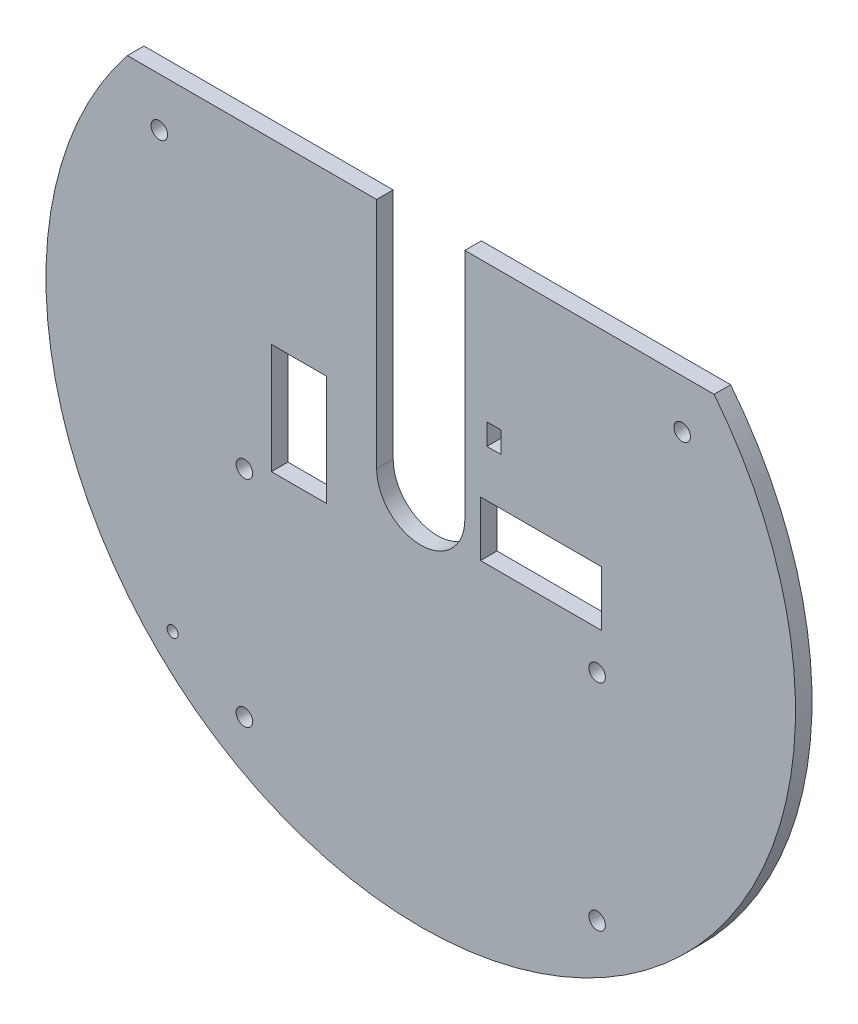
ISO-10303-21;
HEADER;
FILE_DESCRIPTION(('STEP AP214'),'2;1');
FILE_NAME('part.step','',(''),(''),'','','');
FILE_SCHEMA(('AUTOMOTIVE_DESIGN { 1 0 10303 214 1 1 1 1 }'));
ENDSEC;
DATA;
#1=APPLICATION_CONTEXT('core data for automotive mechanical design processes');
#2=APPLICATION_PROTOCOL_DEFINITION('international standard','automotive_design',2000,#1);
#3=PRODUCT_CONTEXT('',#1,'mechanical');
#4=PRODUCT('Part','Part','',(#3));
#5=PRODUCT_RELATED_PRODUCT_CATEGORY('part','',(#4));
#6=PRODUCT_DEFINITION_FORMATION('','',#4);
#7=PRODUCT_DEFINITION_CONTEXT('part definition',#1,'design');
#8=PRODUCT_DEFINITION('design','',#6,#7);
#9=PRODUCT_DEFINITION_SHAPE('','',#8);
#10=(LENGTH_UNIT() NAMED_UNIT(*) SI_UNIT(.MILLI.,.METRE.));
#11=(NAMED_UNIT(*) PLANE_ANGLE_UNIT() SI_UNIT($,.RADIAN.));
#12=(NAMED_UNIT(*) SI_UNIT($,.STERADIAN.) SOLID_ANGLE_UNIT());
#13=UNCERTAINTY_MEASURE_WITH_UNIT(LENGTH_MEASURE(1.E-05),#10,'distance_accuracy_value','');
#14=(GEOMETRIC_REPRESENTATION_CONTEXT(3) GLOBAL_UNCERTAINTY_ASSIGNED_CONTEXT((#13)) GLOBAL_UNIT_ASSIGNED_CONTEXT((#10,
#11,#12)) REPRESENTATION_CONTEXT('',''));
#15=CARTESIAN_POINT('',(0.,0.,0.));
#16=DIRECTION('',(0.,0.,1.));
#17=DIRECTION('',(1.,0.,0.));
#18=AXIS2_PLACEMENT_3D('',#15,#16,#17);
#19=CARTESIAN_POINT('',(0.,0.,3.));
#20=DIRECTION('',(0.,0.,1.));
#21=DIRECTION('',(1.,0.,0.));
#22=AXIS2_PLACEMENT_3D('',#19,#20,#21);
#23=PLANE('',#22);
#24=DIRECTION('',(0.,1.,0.));
#25=VECTOR('',#24,1.);
#26=CARTESIAN_POINT('',(14.6,17.3801510258683,3.));
#27=LINE('',#26,#25);
#28=CARTESIAN_POINT('',(14.6,13.5189651370882,3.));
#29=VERTEX_POINT('',#28);
#30=CARTESIAN_POINT('',(14.6,17.3801510258683,3.));
#31=VERTEX_POINT('',#30);
#32=EDGE_CURVE('E61',#29,#31,#27,.T.);
#33=ORIENTED_EDGE('',*,*,#32,.F.);
#34=DIRECTION('',(1.,0.,0.));
#35=VECTOR('',#34,1.);
#36=CARTESIAN_POINT('',(12.,13.5189651370882,3.));
#37=LINE('',#36,#35);
#38=CARTESIAN_POINT('',(12.,13.5189651370882,3.));
#39=VERTEX_POINT('',#38);
#40=EDGE_CURVE('E192',#39,#29,#37,.T.);
#41=ORIENTED_EDGE('',*,*,#40,.F.);
#42=DIRECTION('',(0.,-1.,0.));
#43=VECTOR('',#42,1.);
#44=CARTESIAN_POINT('',(12.,17.3801510258683,3.));
#45=LINE('',#44,#43);
#46=CARTESIAN_POINT('',(12.,17.3801510258683,3.));
#47=VERTEX_POINT('',#46);
#48=EDGE_CURVE('E196',#47,#39,#45,.T.);
#49=ORIENTED_EDGE('',*,*,#48,.F.);
#50=DIRECTION('',(-1.,0.,0.));
#51=VECTOR('',#50,1.);
#52=CARTESIAN_POINT('',(12.,17.3801510258683,3.));
#53=LINE('',#52,#51);
#54=EDGE_CURVE('E205',#31,#47,#53,.T.);
#55=ORIENTED_EDGE('',*,*,#54,.F.);
#56=EDGE_LOOP('',(#33,#41,#49,#55));
#57=FACE_BOUND('',#56,.T.);
#58=CARTESIAN_POINT('',(32.,-51.,3.));
#59=DIRECTION('',(0.,0.,1.));
#60=DIRECTION('',(-1.,0.,0.));
#61=AXIS2_PLACEMENT_3D('',#58,#59,#60);
#62=CIRCLE('',#61,1.5);
#63=CARTESIAN_POINT('',(30.5,-51.,3.));
#64=VERTEX_POINT('',#63);
#65=EDGE_CURVE('E271',#64,#64,#62,.T.);
#66=ORIENTED_EDGE('',*,*,#65,.F.);
#67=EDGE_LOOP('',(#66));
#68=FACE_BOUND('',#67,.T.);
#69=CARTESIAN_POINT('',(-32.,-12.,3.));
#70=DIRECTION('',(0.,0.,1.));
#71=DIRECTION('',(1.,0.,0.));
#72=AXIS2_PLACEMENT_3D('',#69,#70,#71);
#73=CIRCLE('',#72,1.5);
#74=CARTESIAN_POINT('',(-30.5,-12.,3.));
#75=VERTEX_POINT('',#74);
#76=EDGE_CURVE('E287',#75,#75,#73,.T.);
#77=ORIENTED_EDGE('',*,*,#76,.F.);
#78=EDGE_LOOP('',(#77));
#79=FACE_BOUND('',#78,.T.);
#80=CARTESIAN_POINT('',(-45.012826675006,-44.0777203893971,3.));
#81=DIRECTION('',(0.,0.,1.));
#82=DIRECTION('',(1.,0.,0.));
#83=AXIS2_PLACEMENT_3D('',#80,#81,#82);
#84=CIRCLE('',#83,0.999999999999998);
#85=CARTESIAN_POINT('',(-44.012826675006,-44.0777203893971,3.));
#86=VERTEX_POINT('',#85);
#87=EDGE_CURVE('E303',#86,#86,#84,.T.);
#88=ORIENTED_EDGE('',*,*,#87,.F.);
#89=EDGE_LOOP('',(#88));
#90=FACE_BOUND('',#89,.T.);
#91=DIRECTION('',(1.,0.,0.));
#92=VECTOR('',#91,1.);
#93=CARTESIAN_POINT('',(32.8437854274862,-5.,3.));
#94=LINE('',#93,#92);
#95=CARTESIAN_POINT('',(10.8437854274862,-5.,3.));
#96=VERTEX_POINT('',#95);
#97=CARTESIAN_POINT('',(32.8437854274862,-5.,3.));
#98=VERTEX_POINT('',#97);
#99=EDGE_CURVE('E322',#96,#98,#94,.T.);
#100=ORIENTED_EDGE('',*,*,#99,.F.);
#101=DIRECTION('',(0.,-1.,0.));
#102=VECTOR('',#101,1.);
#103=CARTESIAN_POINT('',(10.8437854274862,5.,3.));
#104=LINE('',#103,#102);
#105=CARTESIAN_POINT('',(10.8437854274862,5.,3.));
#106=VERTEX_POINT('',#105);
#107=EDGE_CURVE('E319',#106,#96,#104,.T.);
#108=ORIENTED_EDGE('',*,*,#107,.F.);
#109=DIRECTION('',(-1.,0.,0.));
#110=VECTOR('',#109,1.);
#111=CARTESIAN_POINT('',(32.8437854274862,5.,3.));
#112=LINE('',#111,#110);
#113=CARTESIAN_POINT('',(32.8437854274862,5.,3.));
#114=VERTEX_POINT('',#113);
#115=EDGE_CURVE('E330',#114,#106,#112,.T.);
#116=ORIENTED_EDGE('',*,*,#115,.F.);
#117=DIRECTION('',(0.,1.,0.));
#118=VECTOR('',#117,1.);
#119=CARTESIAN_POINT('',(32.8437854274862,5.,3.));
#120=LINE('',#119,#118);
#121=EDGE_CURVE('E326',#98,#114,#120,.T.);
#122=ORIENTED_EDGE('',*,*,#121,.F.);
#123=EDGE_LOOP('',(#100,#108,#116,#122));
#124=FACE_BOUND('',#123,.T.);
#125=CARTESIAN_POINT('',(0.,0.,3.));
#126=DIRECTION('',(0.,0.,1.));
#127=DIRECTION('',(1.,0.,0.));
#128=AXIS2_PLACEMENT_3D('',#125,#126,#127);
#129=CIRCLE('',#128,68.);
#130=CARTESIAN_POINT('',(-53.2269216630636,42.3189651370882,3.));
#131=VERTEX_POINT('',#130);
#132=CARTESIAN_POINT('',(53.2269216630636,42.3189651370882,3.));
#133=VERTEX_POINT('',#132);
#134=EDGE_CURVE('E362',#131,#133,#129,.T.);
#135=ORIENTED_EDGE('',*,*,#134,.T.);
#136=DIRECTION('',(-1.,0.,0.));
#137=VECTOR('',#136,1.);
#138=CARTESIAN_POINT('',(53.2269216630636,42.3189651370882,3.));
#139=LINE('',#138,#137);
#140=CARTESIAN_POINT('',(8.,42.3189651370882,3.));
#141=VERTEX_POINT('',#140);
#142=EDGE_CURVE('E366',#133,#141,#139,.T.);
#143=ORIENTED_EDGE('',*,*,#142,.T.);
#144=DIRECTION('',(0.,-1.,0.));
#145=VECTOR('',#144,1.);
#146=CARTESIAN_POINT('',(8.,42.3189651370882,3.));
#147=LINE('',#146,#145);
#148=CARTESIAN_POINT('',(8.,0.,3.));
#149=VERTEX_POINT('',#148);
#150=EDGE_CURVE('E370',#141,#149,#147,.T.);
#151=ORIENTED_EDGE('',*,*,#150,.T.);
#152=CARTESIAN_POINT('',(0.,0.,3.));
#153=DIRECTION('',(0.,0.,-1.));
#154=DIRECTION('',(1.,0.,0.));
#155=AXIS2_PLACEMENT_3D('',#152,#153,#154);
#156=CIRCLE('',#155,8.);
#157=CARTESIAN_POINT('',(-8.,0.,3.));
#158=VERTEX_POINT('',#157);
#159=EDGE_CURVE('E373',#149,#158,#156,.T.);
#160=ORIENTED_EDGE('',*,*,#159,.T.);
#161=DIRECTION('',(0.,1.,0.));
#162=VECTOR('',#161,1.);
#163=CARTESIAN_POINT('',(-8.,0.,3.));
#164=LINE('',#163,#162);
#165=CARTESIAN_POINT('',(-8.,42.3189651370882,3.));
#166=VERTEX_POINT('',#165);
#167=EDGE_CURVE('E376',#158,#166,#164,.T.);
#168=ORIENTED_EDGE('',*,*,#167,.T.);
#169=DIRECTION('',(-1.,0.,0.));
#170=VECTOR('',#169,1.);
#171=CARTESIAN_POINT('',(-8.,42.3189651370882,3.));
#172=LINE('',#171,#170);
#173=EDGE_CURVE('E379',#166,#131,#172,.T.);
#174=ORIENTED_EDGE('',*,*,#173,.T.);
#175=EDGE_LOOP('',(#135,#143,#151,#160,#168,#174));
#176=FACE_BOUND('',#175,.T.);
#177=CARTESIAN_POINT('',(47.4303280748359,33.5,3.));
#178=DIRECTION('',(0.,0.,1.));
#179=DIRECTION('',(-1.,0.,0.));
#180=AXIS2_PLACEMENT_3D('',#177,#178,#179);
#181=CIRCLE('',#180,1.5);
#182=CARTESIAN_POINT('',(45.9303280748359,33.5,3.));
#183=VERTEX_POINT('',#182);
#184=EDGE_CURVE('E311',#183,#183,#181,.T.);
#185=ORIENTED_EDGE('',*,*,#184,.F.);
#186=EDGE_LOOP('',(#185));
#187=FACE_BOUND('',#186,.T.);
#188=CARTESIAN_POINT('',(-47.4303280748359,33.5,3.));
#189=DIRECTION('',(0.,0.,1.));
#190=DIRECTION('',(1.,0.,0.));
#191=AXIS2_PLACEMENT_3D('',#188,#189,#190);
#192=CIRCLE('',#191,1.5);
#193=CARTESIAN_POINT('',(-45.9303280748359,33.5,3.));
#194=VERTEX_POINT('',#193);
#195=EDGE_CURVE('E295',#194,#194,#192,.T.);
#196=ORIENTED_EDGE('',*,*,#195,.F.);
#197=EDGE_LOOP('',(#196));
#198=FACE_BOUND('',#197,.T.);
#199=CARTESIAN_POINT('',(-32.,-51.,3.));
#200=DIRECTION('',(0.,0.,1.));
#201=DIRECTION('',(1.,0.,0.));
#202=AXIS2_PLACEMENT_3D('',#199,#200,#201);
#203=CIRCLE('',#202,1.5);
#204=CARTESIAN_POINT('',(-30.5,-51.,3.));
#205=VERTEX_POINT('',#204);
#206=EDGE_CURVE('E279',#205,#205,#203,.T.);
#207=ORIENTED_EDGE('',*,*,#206,.F.);
#208=EDGE_LOOP('',(#207));
#209=FACE_BOUND('',#208,.T.);
#210=CARTESIAN_POINT('',(32.,-12.,3.));
#211=DIRECTION('',(0.,0.,1.));
#212=DIRECTION('',(-1.,0.,0.));
#213=AXIS2_PLACEMENT_3D('',#210,#211,#212);
#214=CIRCLE('',#213,1.5);
#215=CARTESIAN_POINT('',(30.5,-12.,3.));
#216=VERTEX_POINT('',#215);
#217=EDGE_CURVE('E263',#216,#216,#214,.T.);
#218=ORIENTED_EDGE('',*,*,#217,.F.);
#219=EDGE_LOOP('',(#218));
#220=FACE_BOUND('',#219,.T.);
#221=DIRECTION('',(-1.,0.,0.));
#222=VECTOR('',#221,1.);
#223=CARTESIAN_POINT('',(-27.0947150978087,9.99999999999999,3.));
#224=LINE('',#223,#222);
#225=CARTESIAN_POINT('',(-17.0947150978087,9.99999999999999,3.));
#226=VERTEX_POINT('',#225);
#227=CARTESIAN_POINT('',(-27.0947150978087,9.99999999999999,3.));
#228=VERTEX_POINT('',#227);
#229=EDGE_CURVE('E223',#226,#228,#224,.T.);
#230=ORIENTED_EDGE('',*,*,#229,.F.);
#231=DIRECTION('',(0.,1.,0.));
#232=VECTOR('',#231,1.);
#233=CARTESIAN_POINT('',(-17.0947150978087,9.99999999999999,3.));
#234=LINE('',#233,#232);
#235=CARTESIAN_POINT('',(-17.0947150978087,-10.,3.));
#236=VERTEX_POINT('',#235);
#237=EDGE_CURVE('E220',#236,#226,#234,.T.);
#238=ORIENTED_EDGE('',*,*,#237,.F.);
#239=DIRECTION('',(1.,0.,0.));
#240=VECTOR('',#239,1.);
#241=CARTESIAN_POINT('',(-27.0947150978087,-10.,3.));
#242=LINE('',#241,#240);
#243=CARTESIAN_POINT('',(-27.0947150978087,-10.,3.));
#244=VERTEX_POINT('',#243);
#245=EDGE_CURVE('E231',#244,#236,#242,.T.);
#246=ORIENTED_EDGE('',*,*,#245,.F.);
#247=DIRECTION('',(0.,-1.,0.));
#248=VECTOR('',#247,1.);
#249=CARTESIAN_POINT('',(-27.0947150978087,9.99999999999999,3.));
#250=LINE('',#249,#248);
#251=EDGE_CURVE('E227',#228,#244,#250,.T.);
#252=ORIENTED_EDGE('',*,*,#251,.F.);
#253=EDGE_LOOP('',(#230,#238,#246,#252));
#254=FACE_BOUND('',#253,.T.);
#255=ADVANCED_FACE('F45',(#57,#68,#79,#90,#124,#176,#187,#198,#209,#220,#254),#23,.T.);
#256=CARTESIAN_POINT('',(0.,0.,0.));
#257=DIRECTION('',(0.,0.,1.));
#258=DIRECTION('',(1.,0.,0.));
#259=AXIS2_PLACEMENT_3D('',#256,#257,#258);
#260=PLANE('',#259);
#261=DIRECTION('',(1.,0.,0.));
#262=VECTOR('',#261,1.);
#263=CARTESIAN_POINT('',(12.,13.5189651370882,0.));
#264=LINE('',#263,#262);
#265=CARTESIAN_POINT('',(12.,13.5189651370882,0.));
#266=VERTEX_POINT('',#265);
#267=CARTESIAN_POINT('',(14.6,13.5189651370882,0.));
#268=VERTEX_POINT('',#267);
#269=EDGE_CURVE('E180',#266,#268,#264,.T.);
#270=ORIENTED_EDGE('',*,*,#269,.T.);
#271=DIRECTION('',(0.,1.,0.));
#272=VECTOR('',#271,1.);
#273=CARTESIAN_POINT('',(14.6,17.3801510258683,0.));
#274=LINE('',#273,#272);
#275=CARTESIAN_POINT('',(14.6,17.3801510258683,0.));
#276=VERTEX_POINT('',#275);
#277=EDGE_CURVE('E173',#268,#276,#274,.T.);
#278=ORIENTED_EDGE('',*,*,#277,.T.);
#279=DIRECTION('',(-1.,0.,0.));
#280=VECTOR('',#279,1.);
#281=CARTESIAN_POINT('',(12.,17.3801510258683,0.));
#282=LINE('',#281,#280);
#283=CARTESIAN_POINT('',(12.,17.3801510258683,0.));
#284=VERTEX_POINT('',#283);
#285=EDGE_CURVE('E183',#276,#284,#282,.T.);
#286=ORIENTED_EDGE('',*,*,#285,.T.);
#287=DIRECTION('',(0.,-1.,0.));
#288=VECTOR('',#287,1.);
#289=CARTESIAN_POINT('',(12.,17.3801510258683,0.));
#290=LINE('',#289,#288);
#291=EDGE_CURVE('E69',#284,#266,#290,.T.);
#292=ORIENTED_EDGE('',*,*,#291,.T.);
#293=EDGE_LOOP('',(#270,#278,#286,#292));
#294=FACE_BOUND('',#293,.T.);
#295=CARTESIAN_POINT('',(32.,-12.,0.));
#296=DIRECTION('',(0.,0.,1.));
#297=DIRECTION('',(-1.,0.,0.));
#298=AXIS2_PLACEMENT_3D('',#295,#296,#297);
#299=CIRCLE('',#298,1.5);
#300=CARTESIAN_POINT('',(30.5,-12.,0.));
#301=VERTEX_POINT('',#300);
#302=EDGE_CURVE('E262',#301,#301,#299,.T.);
#303=ORIENTED_EDGE('',*,*,#302,.T.);
#304=EDGE_LOOP('',(#303));
#305=FACE_BOUND('',#304,.T.);
#306=CARTESIAN_POINT('',(32.,-51.,0.));
#307=DIRECTION('',(0.,0.,1.));
#308=DIRECTION('',(-1.,0.,0.));
#309=AXIS2_PLACEMENT_3D('',#306,#307,#308);
#310=CIRCLE('',#309,1.5);
#311=CARTESIAN_POINT('',(30.5,-51.,0.));
#312=VERTEX_POINT('',#311);
#313=EDGE_CURVE('E267',#312,#312,#310,.T.);
#314=ORIENTED_EDGE('',*,*,#313,.T.);
#315=EDGE_LOOP('',(#314));
#316=FACE_BOUND('',#315,.T.);
#317=CARTESIAN_POINT('',(-32.,-51.,0.));
#318=DIRECTION('',(0.,0.,1.));
#319=DIRECTION('',(1.,0.,0.));
#320=AXIS2_PLACEMENT_3D('',#317,#318,#319);
#321=CIRCLE('',#320,1.5);
#322=CARTESIAN_POINT('',(-30.5,-51.,0.));
#323=VERTEX_POINT('',#322);
#324=EDGE_CURVE('E275',#323,#323,#321,.T.);
#325=ORIENTED_EDGE('',*,*,#324,.T.);
#326=EDGE_LOOP('',(#325));
#327=FACE_BOUND('',#326,.T.);
#328=CARTESIAN_POINT('',(-32.,-12.,0.));
#329=DIRECTION('',(0.,0.,1.));
#330=DIRECTION('',(1.,0.,0.));
#331=AXIS2_PLACEMENT_3D('',#328,#329,#330);
#332=CIRCLE('',#331,1.5);
#333=CARTESIAN_POINT('',(-30.5,-12.,0.));
#334=VERTEX_POINT('',#333);
#335=EDGE_CURVE('E283',#334,#334,#332,.T.);
#336=ORIENTED_EDGE('',*,*,#335,.T.);
#337=EDGE_LOOP('',(#336));
#338=FACE_BOUND('',#337,.T.);
#339=CARTESIAN_POINT('',(-47.4303280748359,33.5,0.));
#340=DIRECTION('',(0.,0.,1.));
#341=DIRECTION('',(1.,0.,0.));
#342=AXIS2_PLACEMENT_3D('',#339,#340,#341);
#343=CIRCLE('',#342,1.5);
#344=CARTESIAN_POINT('',(-45.9303280748359,33.5,0.));
#345=VERTEX_POINT('',#344);
#346=EDGE_CURVE('E291',#345,#345,#343,.T.);
#347=ORIENTED_EDGE('',*,*,#346,.T.);
#348=EDGE_LOOP('',(#347));
#349=FACE_BOUND('',#348,.T.);
#350=CARTESIAN_POINT('',(-45.012826675006,-44.0777203893971,0.));
#351=DIRECTION('',(0.,0.,1.));
#352=DIRECTION('',(1.,0.,0.));
#353=AXIS2_PLACEMENT_3D('',#350,#351,#352);
#354=CIRCLE('',#353,0.999999999999998);
#355=CARTESIAN_POINT('',(-44.012826675006,-44.0777203893971,0.));
#356=VERTEX_POINT('',#355);
#357=EDGE_CURVE('E299',#356,#356,#354,.T.);
#358=ORIENTED_EDGE('',*,*,#357,.T.);
#359=EDGE_LOOP('',(#358));
#360=FACE_BOUND('',#359,.T.);
#361=CARTESIAN_POINT('',(47.4303280748359,33.5,0.));
#362=DIRECTION('',(0.,0.,1.));
#363=DIRECTION('',(-1.,0.,0.));
#364=AXIS2_PLACEMENT_3D('',#361,#362,#363);
#365=CIRCLE('',#364,1.5);
#366=CARTESIAN_POINT('',(45.9303280748359,33.5,0.));
#367=VERTEX_POINT('',#366);
#368=EDGE_CURVE('E307',#367,#367,#365,.T.);
#369=ORIENTED_EDGE('',*,*,#368,.T.);
#370=EDGE_LOOP('',(#369));
#371=FACE_BOUND('',#370,.T.);
#372=DIRECTION('',(0.,-1.,0.));
#373=VECTOR('',#372,1.);
#374=CARTESIAN_POINT('',(10.8437854274862,5.,0.));
#375=LINE('',#374,#373);
#376=CARTESIAN_POINT('',(10.8437854274862,5.,0.));
#377=VERTEX_POINT('',#376);
#378=CARTESIAN_POINT('',(10.8437854274862,-5.,0.));
#379=VERTEX_POINT('',#378);
#380=EDGE_CURVE('E315',#377,#379,#375,.T.);
#381=ORIENTED_EDGE('',*,*,#380,.T.);
#382=DIRECTION('',(1.,0.,0.));
#383=VECTOR('',#382,1.);
#384=CARTESIAN_POINT('',(32.8437854274862,-5.,0.));
#385=LINE('',#384,#383);
#386=CARTESIAN_POINT('',(32.8437854274862,-5.,0.));
#387=VERTEX_POINT('',#386);
#388=EDGE_CURVE('E337',#379,#387,#385,.T.);
#389=ORIENTED_EDGE('',*,*,#388,.T.);
#390=DIRECTION('',(0.,1.,0.));
#391=VECTOR('',#390,1.);
#392=CARTESIAN_POINT('',(32.8437854274862,5.,0.));
#393=LINE('',#392,#391);
#394=CARTESIAN_POINT('',(32.8437854274862,5.,0.));
#395=VERTEX_POINT('',#394);
#396=EDGE_CURVE('E341',#387,#395,#393,.T.);
#397=ORIENTED_EDGE('',*,*,#396,.T.);
#398=DIRECTION('',(-1.,0.,0.));
#399=VECTOR('',#398,1.);
#400=CARTESIAN_POINT('',(32.8437854274862,5.,0.));
#401=LINE('',#400,#399);
#402=EDGE_CURVE('E323',#395,#377,#401,.T.);
#403=ORIENTED_EDGE('',*,*,#402,.T.);
#404=EDGE_LOOP('',(#381,#389,#397,#403));
#405=FACE_BOUND('',#404,.T.);
#406=CARTESIAN_POINT('',(0.,0.,0.));
#407=DIRECTION('',(0.,0.,1.));
#408=DIRECTION('',(1.,0.,0.));
#409=AXIS2_PLACEMENT_3D('',#406,#407,#408);
#410=CIRCLE('',#409,68.);
#411=CARTESIAN_POINT('',(-53.2269216630636,42.3189651370882,0.));
#412=VERTEX_POINT('',#411);
#413=CARTESIAN_POINT('',(53.2269216630636,42.3189651370882,0.));
#414=VERTEX_POINT('',#413);
#415=EDGE_CURVE('E361',#412,#414,#410,.T.);
#416=ORIENTED_EDGE('',*,*,#415,.F.);
#417=DIRECTION('',(-1.,0.,0.));
#418=VECTOR('',#417,1.);
#419=CARTESIAN_POINT('',(-8.,42.3189651370882,0.));
#420=LINE('',#419,#418);
#421=CARTESIAN_POINT('',(-8.,42.3189651370882,0.));
#422=VERTEX_POINT('',#421);
#423=EDGE_CURVE('E367',#422,#412,#420,.T.);
#424=ORIENTED_EDGE('',*,*,#423,.F.);
#425=DIRECTION('',(0.,1.,0.));
#426=VECTOR('',#425,1.);
#427=CARTESIAN_POINT('',(-8.,0.,0.));
#428=LINE('',#427,#426);
#429=CARTESIAN_POINT('',(-8.,0.,0.));
#430=VERTEX_POINT('',#429);
#431=EDGE_CURVE('E395',#430,#422,#428,.T.);
#432=ORIENTED_EDGE('',*,*,#431,.F.);
#433=CARTESIAN_POINT('',(0.,0.,0.));
#434=DIRECTION('',(0.,0.,-1.));
#435=DIRECTION('',(1.,0.,0.));
#436=AXIS2_PLACEMENT_3D('',#433,#434,#435);
#437=CIRCLE('',#436,8.);
#438=CARTESIAN_POINT('',(8.,0.,0.));
#439=VERTEX_POINT('',#438);
#440=EDGE_CURVE('E392',#439,#430,#437,.T.);
#441=ORIENTED_EDGE('',*,*,#440,.F.);
#442=DIRECTION('',(0.,-1.,0.));
#443=VECTOR('',#442,1.);
#444=CARTESIAN_POINT('',(8.,42.3189651370882,0.));
#445=LINE('',#444,#443);
#446=CARTESIAN_POINT('',(8.,42.3189651370882,0.));
#447=VERTEX_POINT('',#446);
#448=EDGE_CURVE('E389',#447,#439,#445,.T.);
#449=ORIENTED_EDGE('',*,*,#448,.F.);
#450=DIRECTION('',(-1.,0.,0.));
#451=VECTOR('',#450,1.);
#452=CARTESIAN_POINT('',(53.2269216630636,42.3189651370882,0.));
#453=LINE('',#452,#451);
#454=EDGE_CURVE('E386',#414,#447,#453,.T.);
#455=ORIENTED_EDGE('',*,*,#454,.F.);
#456=EDGE_LOOP('',(#416,#424,#432,#441,#449,#455));
#457=FACE_BOUND('',#456,.T.);
#458=DIRECTION('',(0.,1.,0.));
#459=VECTOR('',#458,1.);
#460=CARTESIAN_POINT('',(-17.0947150978087,9.99999999999999,0.));
#461=LINE('',#460,#459);
#462=CARTESIAN_POINT('',(-17.0947150978087,-10.,0.));
#463=VERTEX_POINT('',#462);
#464=CARTESIAN_POINT('',(-17.0947150978087,9.99999999999999,0.));
#465=VERTEX_POINT('',#464);
#466=EDGE_CURVE('E214',#463,#465,#461,.T.);
#467=ORIENTED_EDGE('',*,*,#466,.T.);
#468=DIRECTION('',(-1.,0.,0.));
#469=VECTOR('',#468,1.);
#470=CARTESIAN_POINT('',(-27.0947150978087,9.99999999999999,0.));
#471=LINE('',#470,#469);
#472=CARTESIAN_POINT('',(-27.0947150978087,9.99999999999999,0.));
#473=VERTEX_POINT('',#472);
#474=EDGE_CURVE('E238',#465,#473,#471,.T.);
#475=ORIENTED_EDGE('',*,*,#474,.T.);
#476=DIRECTION('',(0.,-1.,0.));
#477=VECTOR('',#476,1.);
#478=CARTESIAN_POINT('',(-27.0947150978087,9.99999999999999,0.));
#479=LINE('',#478,#477);
#480=CARTESIAN_POINT('',(-27.0947150978087,-10.,0.));
#481=VERTEX_POINT('',#480);
#482=EDGE_CURVE('E242',#473,#481,#479,.T.);
#483=ORIENTED_EDGE('',*,*,#482,.T.);
#484=DIRECTION('',(1.,0.,0.));
#485=VECTOR('',#484,1.);
#486=CARTESIAN_POINT('',(-27.0947150978087,-10.,0.));
#487=LINE('',#486,#485);
#488=EDGE_CURVE('E224',#481,#463,#487,.T.);
#489=ORIENTED_EDGE('',*,*,#488,.T.);
#490=EDGE_LOOP('',(#467,#475,#483,#489));
#491=FACE_BOUND('',#490,.T.);
#492=ADVANCED_FACE('F188',(#294,#305,#316,#327,#338,#349,#360,#371,#405,#457,#491),#260,.F.);
#493=CARTESIAN_POINT('',(0.,0.,3.));
#494=DIRECTION('',(0.,0.,-1.));
#495=DIRECTION('',(-1.,0.,0.));
#496=AXIS2_PLACEMENT_3D('',#493,#494,#495);
#497=CYLINDRICAL_SURFACE('',#496,68.);
#498=ORIENTED_EDGE('',*,*,#415,.T.);
#499=DIRECTION('',(0.,0.,-1.));
#500=VECTOR('',#499,1.);
#501=CARTESIAN_POINT('',(53.2269216630636,42.3189651370882,3.));
#502=LINE('',#501,#500);
#503=EDGE_CURVE('E11',#133,#414,#502,.T.);
#504=ORIENTED_EDGE('',*,*,#503,.F.);
#505=ORIENTED_EDGE('',*,*,#134,.F.);
#506=DIRECTION('',(0.,0.,-1.));
#507=VECTOR('',#506,1.);
#508=CARTESIAN_POINT('',(-53.2269216630636,42.3189651370882,3.));
#509=LINE('',#508,#507);
#510=EDGE_CURVE('E382',#131,#412,#509,.T.);
#511=ORIENTED_EDGE('',*,*,#510,.T.);
#512=EDGE_LOOP('',(#498,#504,#505,#511));
#513=FACE_BOUND('',#512,.T.);
#514=ADVANCED_FACE('F47',(#513),#497,.T.);
#515=CARTESIAN_POINT('',(53.2269216630636,42.3189651370882,3.));
#516=DIRECTION('',(0.,-1.,0.));
#517=DIRECTION('',(1.,0.,0.));
#518=AXIS2_PLACEMENT_3D('',#515,#516,#517);
#519=PLANE('',#518);
#520=ORIENTED_EDGE('',*,*,#454,.T.);
#521=DIRECTION('',(0.,0.,-1.));
#522=VECTOR('',#521,1.);
#523=CARTESIAN_POINT('',(8.,42.3189651370882,3.));
#524=LINE('',#523,#522);
#525=EDGE_CURVE('E54',#141,#447,#524,.T.);
#526=ORIENTED_EDGE('',*,*,#525,.F.);
#527=ORIENTED_EDGE('',*,*,#142,.F.);
#528=ORIENTED_EDGE('',*,*,#503,.T.);
#529=EDGE_LOOP('',(#520,#526,#527,#528));
#530=FACE_BOUND('',#529,.T.);
#531=ADVANCED_FACE('F443',(#530),#519,.F.);
#532=CARTESIAN_POINT('',(8.,42.3189651370882,3.));
#533=DIRECTION('',(1.,0.,0.));
#534=DIRECTION('',(0.,0.,-1.));
#535=AXIS2_PLACEMENT_3D('',#532,#533,#534);
#536=PLANE('',#535);
#537=ORIENTED_EDGE('',*,*,#448,.T.);
#538=DIRECTION('',(0.,0.,-1.));
#539=VECTOR('',#538,1.);
#540=CARTESIAN_POINT('',(8.,0.,3.));
#541=LINE('',#540,#539);
#542=EDGE_CURVE('E411',#149,#439,#541,.T.);
#543=ORIENTED_EDGE('',*,*,#542,.F.);
#544=ORIENTED_EDGE('',*,*,#150,.F.);
#545=ORIENTED_EDGE('',*,*,#525,.T.);
#546=EDGE_LOOP('',(#537,#543,#544,#545));
#547=FACE_BOUND('',#546,.T.);
#548=ADVANCED_FACE('F420',(#547),#536,.F.);
#549=CARTESIAN_POINT('',(0.,0.,3.));
#550=DIRECTION('',(0.,0.,-1.));
#551=DIRECTION('',(-1.,0.,0.));
#552=AXIS2_PLACEMENT_3D('',#549,#550,#551);
#553=CYLINDRICAL_SURFACE('',#552,8.);
#554=ORIENTED_EDGE('',*,*,#440,.T.);
#555=DIRECTION('',(0.,0.,-1.));
#556=VECTOR('',#555,1.);
#557=CARTESIAN_POINT('',(-8.,0.,3.));
#558=LINE('',#557,#556);
#559=EDGE_CURVE('E407',#158,#430,#558,.T.);
#560=ORIENTED_EDGE('',*,*,#559,.F.);
#561=ORIENTED_EDGE('',*,*,#159,.F.);
#562=ORIENTED_EDGE('',*,*,#542,.T.);
#563=EDGE_LOOP('',(#554,#560,#561,#562));
#564=FACE_BOUND('',#563,.T.);
#565=ADVANCED_FACE('F431',(#564),#553,.F.);
#566=CARTESIAN_POINT('',(-8.,0.,3.));
#567=DIRECTION('',(-1.,0.,0.));
#568=DIRECTION('',(0.,0.,1.));
#569=AXIS2_PLACEMENT_3D('',#566,#567,#568);
#570=PLANE('',#569);
#571=ORIENTED_EDGE('',*,*,#431,.T.);
#572=DIRECTION('',(0.,0.,-1.));
#573=VECTOR('',#572,1.);
#574=CARTESIAN_POINT('',(-8.,42.3189651370882,3.));
#575=LINE('',#574,#573);
#576=EDGE_CURVE('E403',#166,#422,#575,.T.);
#577=ORIENTED_EDGE('',*,*,#576,.F.);
#578=ORIENTED_EDGE('',*,*,#167,.F.);
#579=ORIENTED_EDGE('',*,*,#559,.T.);
#580=EDGE_LOOP('',(#571,#577,#578,#579));
#581=FACE_BOUND('',#580,.T.);
#582=ADVANCED_FACE('F435',(#581),#570,.F.);
#583=CARTESIAN_POINT('',(-8.,42.3189651370882,3.));
#584=DIRECTION('',(0.,-1.,0.));
#585=DIRECTION('',(0.,0.,-1.));
#586=AXIS2_PLACEMENT_3D('',#583,#584,#585);
#587=PLANE('',#586);
#588=ORIENTED_EDGE('',*,*,#423,.T.);
#589=ORIENTED_EDGE('',*,*,#510,.F.);
#590=ORIENTED_EDGE('',*,*,#173,.F.);
#591=ORIENTED_EDGE('',*,*,#576,.T.);
#592=EDGE_LOOP('',(#588,#589,#590,#591));
#593=FACE_BOUND('',#592,.T.);
#594=ADVANCED_FACE('F446',(#593),#587,.F.);
#595=CARTESIAN_POINT('',(10.8437854274862,5.,3.));
#596=DIRECTION('',(1.,0.,0.));
#597=DIRECTION('',(0.,1.,0.));
#598=AXIS2_PLACEMENT_3D('',#595,#596,#597);
#599=PLANE('',#598);
#600=ORIENTED_EDGE('',*,*,#380,.F.);
#601=DIRECTION('',(0.,0.,-1.));
#602=VECTOR('',#601,1.);
#603=CARTESIAN_POINT('',(10.8437854274862,5.,3.));
#604=LINE('',#603,#602);
#605=EDGE_CURVE('E333',#106,#377,#604,.T.);
#606=ORIENTED_EDGE('',*,*,#605,.F.);
#607=ORIENTED_EDGE('',*,*,#107,.T.);
#608=DIRECTION('',(0.,0.,-1.));
#609=VECTOR('',#608,1.);
#610=CARTESIAN_POINT('',(10.8437854274862,-5.,3.));
#611=LINE('',#610,#609);
#612=EDGE_CURVE('E357',#96,#379,#611,.T.);
#613=ORIENTED_EDGE('',*,*,#612,.T.);
#614=EDGE_LOOP('',(#600,#606,#607,#613));
#615=FACE_BOUND('',#614,.T.);
#616=ADVANCED_FACE('F448',(#615),#599,.T.);
#617=CARTESIAN_POINT('',(32.8437854274862,-5.,3.));
#618=DIRECTION('',(0.,1.,0.));
#619=DIRECTION('',(-1.,0.,0.));
#620=AXIS2_PLACEMENT_3D('',#617,#618,#619);
#621=PLANE('',#620);
#622=ORIENTED_EDGE('',*,*,#388,.F.);
#623=ORIENTED_EDGE('',*,*,#612,.F.);
#624=ORIENTED_EDGE('',*,*,#99,.T.);
#625=DIRECTION('',(0.,0.,-1.));
#626=VECTOR('',#625,1.);
#627=CARTESIAN_POINT('',(32.8437854274862,-5.,3.));
#628=LINE('',#627,#626);
#629=EDGE_CURVE('E354',#98,#387,#628,.T.);
#630=ORIENTED_EDGE('',*,*,#629,.T.);
#631=EDGE_LOOP('',(#622,#623,#624,#630));
#632=FACE_BOUND('',#631,.T.);
#633=ADVANCED_FACE('F454',(#632),#621,.T.);
#634=CARTESIAN_POINT('',(32.8437854274862,5.,3.));
#635=DIRECTION('',(-1.,0.,0.));
#636=DIRECTION('',(0.,0.,1.));
#637=AXIS2_PLACEMENT_3D('',#634,#635,#636);
#638=PLANE('',#637);
#639=ORIENTED_EDGE('',*,*,#396,.F.);
#640=ORIENTED_EDGE('',*,*,#629,.F.);
#641=ORIENTED_EDGE('',*,*,#121,.T.);
#642=DIRECTION('',(0.,0.,-1.));
#643=VECTOR('',#642,1.);
#644=CARTESIAN_POINT('',(32.8437854274862,5.,3.));
#645=LINE('',#644,#643);
#646=EDGE_CURVE('E351',#114,#395,#645,.T.);
#647=ORIENTED_EDGE('',*,*,#646,.T.);
#648=EDGE_LOOP('',(#639,#640,#641,#647));
#649=FACE_BOUND('',#648,.T.);
#650=ADVANCED_FACE('F470',(#649),#638,.T.);
#651=CARTESIAN_POINT('',(32.8437854274862,5.,3.));
#652=DIRECTION('',(0.,-1.,0.));
#653=DIRECTION('',(1.,0.,0.));
#654=AXIS2_PLACEMENT_3D('',#651,#652,#653);
#655=PLANE('',#654);
#656=ORIENTED_EDGE('',*,*,#402,.F.);
#657=ORIENTED_EDGE('',*,*,#646,.F.);
#658=ORIENTED_EDGE('',*,*,#115,.T.);
#659=ORIENTED_EDGE('',*,*,#605,.T.);
#660=EDGE_LOOP('',(#656,#657,#658,#659));
#661=FACE_BOUND('',#660,.T.);
#662=ADVANCED_FACE('F474',(#661),#655,.T.);
#663=CARTESIAN_POINT('',(47.4303280748359,33.5,3.));
#664=DIRECTION('',(0.,0.,-1.));
#665=DIRECTION('',(-1.,0.,0.));
#666=AXIS2_PLACEMENT_3D('',#663,#664,#665);
#667=CYLINDRICAL_SURFACE('',#666,1.5);
#668=ORIENTED_EDGE('',*,*,#184,.T.);
#669=EDGE_LOOP('',(#668));
#670=FACE_BOUND('',#669,.T.);
#671=ORIENTED_EDGE('',*,*,#368,.F.);
#672=EDGE_LOOP('',(#671));
#673=FACE_BOUND('',#672,.T.);
#674=ADVANCED_FACE('F478',(#670,#673),#667,.F.);
#675=CARTESIAN_POINT('',(-45.012826675006,-44.0777203893971,3.));
#676=DIRECTION('',(0.,0.,-1.));
#677=DIRECTION('',(-1.,0.,0.));
#678=AXIS2_PLACEMENT_3D('',#675,#676,#677);
#679=CYLINDRICAL_SURFACE('',#678,0.999999999999998);
#680=ORIENTED_EDGE('',*,*,#87,.T.);
#681=EDGE_LOOP('',(#680));
#682=FACE_BOUND('',#681,.T.);
#683=ORIENTED_EDGE('',*,*,#357,.F.);
#684=EDGE_LOOP('',(#683));
#685=FACE_BOUND('',#684,.T.);
#686=ADVANCED_FACE('F482',(#682,#685),#679,.F.);
#687=CARTESIAN_POINT('',(-47.4303280748359,33.5,3.));
#688=DIRECTION('',(0.,0.,-1.));
#689=DIRECTION('',(-1.,0.,0.));
#690=AXIS2_PLACEMENT_3D('',#687,#688,#689);
#691=CYLINDRICAL_SURFACE('',#690,1.5);
#692=ORIENTED_EDGE('',*,*,#195,.T.);
#693=EDGE_LOOP('',(#692));
#694=FACE_BOUND('',#693,.T.);
#695=ORIENTED_EDGE('',*,*,#346,.F.);
#696=EDGE_LOOP('',(#695));
#697=FACE_BOUND('',#696,.T.);
#698=ADVANCED_FACE('F486',(#694,#697),#691,.F.);
#699=CARTESIAN_POINT('',(-32.,-12.,3.));
#700=DIRECTION('',(0.,0.,-1.));
#701=DIRECTION('',(-1.,0.,0.));
#702=AXIS2_PLACEMENT_3D('',#699,#700,#701);
#703=CYLINDRICAL_SURFACE('',#702,1.5);
#704=ORIENTED_EDGE('',*,*,#76,.T.);
#705=EDGE_LOOP('',(#704));
#706=FACE_BOUND('',#705,.T.);
#707=ORIENTED_EDGE('',*,*,#335,.F.);
#708=EDGE_LOOP('',(#707));
#709=FACE_BOUND('',#708,.T.);
#710=ADVANCED_FACE('F490',(#706,#709),#703,.F.);
#711=CARTESIAN_POINT('',(-32.,-51.,3.));
#712=DIRECTION('',(0.,0.,-1.));
#713=DIRECTION('',(-1.,0.,0.));
#714=AXIS2_PLACEMENT_3D('',#711,#712,#713);
#715=CYLINDRICAL_SURFACE('',#714,1.5);
#716=ORIENTED_EDGE('',*,*,#206,.T.);
#717=EDGE_LOOP('',(#716));
#718=FACE_BOUND('',#717,.T.);
#719=ORIENTED_EDGE('',*,*,#324,.F.);
#720=EDGE_LOOP('',(#719));
#721=FACE_BOUND('',#720,.T.);
#722=ADVANCED_FACE('F494',(#718,#721),#715,.F.);
#723=CARTESIAN_POINT('',(32.,-51.,3.));
#724=DIRECTION('',(0.,0.,-1.));
#725=DIRECTION('',(-1.,0.,0.));
#726=AXIS2_PLACEMENT_3D('',#723,#724,#725);
#727=CYLINDRICAL_SURFACE('',#726,1.5);
#728=ORIENTED_EDGE('',*,*,#65,.T.);
#729=EDGE_LOOP('',(#728));
#730=FACE_BOUND('',#729,.T.);
#731=ORIENTED_EDGE('',*,*,#313,.F.);
#732=EDGE_LOOP('',(#731));
#733=FACE_BOUND('',#732,.T.);
#734=ADVANCED_FACE('F498',(#730,#733),#727,.F.);
#735=CARTESIAN_POINT('',(32.,-12.,3.));
#736=DIRECTION('',(0.,0.,-1.));
#737=DIRECTION('',(-1.,0.,0.));
#738=AXIS2_PLACEMENT_3D('',#735,#736,#737);
#739=CYLINDRICAL_SURFACE('',#738,1.5);
#740=ORIENTED_EDGE('',*,*,#217,.T.);
#741=EDGE_LOOP('',(#740));
#742=FACE_BOUND('',#741,.T.);
#743=ORIENTED_EDGE('',*,*,#302,.F.);
#744=EDGE_LOOP('',(#743));
#745=FACE_BOUND('',#744,.T.);
#746=ADVANCED_FACE('F502',(#742,#745),#739,.F.);
#747=CARTESIAN_POINT('',(-17.0947150978087,9.99999999999999,3.));
#748=DIRECTION('',(-1.,0.,0.));
#749=DIRECTION('',(0.,-1.,0.));
#750=AXIS2_PLACEMENT_3D('',#747,#748,#749);
#751=PLANE('',#750);
#752=ORIENTED_EDGE('',*,*,#466,.F.);
#753=DIRECTION('',(0.,0.,-1.));
#754=VECTOR('',#753,1.);
#755=CARTESIAN_POINT('',(-17.0947150978087,-10.,3.));
#756=LINE('',#755,#754);
#757=EDGE_CURVE('E234',#236,#463,#756,.T.);
#758=ORIENTED_EDGE('',*,*,#757,.F.);
#759=ORIENTED_EDGE('',*,*,#237,.T.);
#760=DIRECTION('',(0.,0.,-1.));
#761=VECTOR('',#760,1.);
#762=CARTESIAN_POINT('',(-17.0947150978087,9.99999999999999,3.));
#763=LINE('',#762,#761);
#764=EDGE_CURVE('E258',#226,#465,#763,.T.);
#765=ORIENTED_EDGE('',*,*,#764,.T.);
#766=EDGE_LOOP('',(#752,#758,#759,#765));
#767=FACE_BOUND('',#766,.T.);
#768=ADVANCED_FACE('F506',(#767),#751,.T.);
#769=CARTESIAN_POINT('',(-27.0947150978087,9.99999999999999,3.));
#770=DIRECTION('',(0.,-1.,0.));
#771=DIRECTION('',(1.,0.,0.));
#772=AXIS2_PLACEMENT_3D('',#769,#770,#771);
#773=PLANE('',#772);
#774=ORIENTED_EDGE('',*,*,#474,.F.);
#775=ORIENTED_EDGE('',*,*,#764,.F.);
#776=ORIENTED_EDGE('',*,*,#229,.T.);
#777=DIRECTION('',(0.,0.,-1.));
#778=VECTOR('',#777,1.);
#779=CARTESIAN_POINT('',(-27.0947150978087,9.99999999999999,3.));
#780=LINE('',#779,#778);
#781=EDGE_CURVE('E255',#228,#473,#780,.T.);
#782=ORIENTED_EDGE('',*,*,#781,.T.);
#783=EDGE_LOOP('',(#774,#775,#776,#782));
#784=FACE_BOUND('',#783,.T.);
#785=ADVANCED_FACE('F510',(#784),#773,.T.);
#786=CARTESIAN_POINT('',(-27.0947150978087,9.99999999999999,3.));
#787=DIRECTION('',(1.,0.,0.));
#788=DIRECTION('',(0.,0.,-1.));
#789=AXIS2_PLACEMENT_3D('',#786,#787,#788);
#790=PLANE('',#789);
#791=ORIENTED_EDGE('',*,*,#482,.F.);
#792=ORIENTED_EDGE('',*,*,#781,.F.);
#793=ORIENTED_EDGE('',*,*,#251,.T.);
#794=DIRECTION('',(0.,0.,-1.));
#795=VECTOR('',#794,1.);
#796=CARTESIAN_POINT('',(-27.0947150978087,-10.,3.));
#797=LINE('',#796,#795);
#798=EDGE_CURVE('E252',#244,#481,#797,.T.);
#799=ORIENTED_EDGE('',*,*,#798,.T.);
#800=EDGE_LOOP('',(#791,#792,#793,#799));
#801=FACE_BOUND('',#800,.T.);
#802=ADVANCED_FACE('F514',(#801),#790,.T.);
#803=CARTESIAN_POINT('',(-27.0947150978087,-10.,3.));
#804=DIRECTION('',(0.,1.,0.));
#805=DIRECTION('',(0.,0.,1.));
#806=AXIS2_PLACEMENT_3D('',#803,#804,#805);
#807=PLANE('',#806);
#808=ORIENTED_EDGE('',*,*,#488,.F.);
#809=ORIENTED_EDGE('',*,*,#798,.F.);
#810=ORIENTED_EDGE('',*,*,#245,.T.);
#811=ORIENTED_EDGE('',*,*,#757,.T.);
#812=EDGE_LOOP('',(#808,#809,#810,#811));
#813=FACE_BOUND('',#812,.T.);
#814=ADVANCED_FACE('F518',(#813),#807,.T.);
#815=CARTESIAN_POINT('',(14.6,17.3801510258683,0.));
#816=DIRECTION('',(1.,0.,0.));
#817=DIRECTION('',(0.,0.,-1.));
#818=AXIS2_PLACEMENT_3D('',#815,#816,#817);
#819=PLANE('',#818);
#820=ORIENTED_EDGE('',*,*,#32,.T.);
#821=DIRECTION('',(0.,0.,1.));
#822=VECTOR('',#821,1.);
#823=CARTESIAN_POINT('',(14.6,17.3801510258683,0.));
#824=LINE('',#823,#822);
#825=EDGE_CURVE('E169',#276,#31,#824,.T.);
#826=ORIENTED_EDGE('',*,*,#825,.F.);
#827=ORIENTED_EDGE('',*,*,#277,.F.);
#828=DIRECTION('',(0.,0.,1.));
#829=VECTOR('',#828,1.);
#830=CARTESIAN_POINT('',(14.6,13.5189651370882,0.));
#831=LINE('',#830,#829);
#832=EDGE_CURVE('E211',#268,#29,#831,.T.);
#833=ORIENTED_EDGE('',*,*,#832,.T.);
#834=EDGE_LOOP('',(#820,#826,#827,#833));
#835=FACE_BOUND('',#834,.T.);
#836=ADVANCED_FACE('F171',(#835),#819,.F.);
#837=CARTESIAN_POINT('',(12.,13.5189651370882,0.));
#838=DIRECTION('',(0.,-1.,0.));
#839=DIRECTION('',(0.,0.,-1.));
#840=AXIS2_PLACEMENT_3D('',#837,#838,#839);
#841=PLANE('',#840);
#842=ORIENTED_EDGE('',*,*,#40,.T.);
#843=ORIENTED_EDGE('',*,*,#832,.F.);
#844=ORIENTED_EDGE('',*,*,#269,.F.);
#845=DIRECTION('',(0.,0.,1.));
#846=VECTOR('',#845,1.);
#847=CARTESIAN_POINT('',(12.,13.5189651370882,0.));
#848=LINE('',#847,#846);
#849=EDGE_CURVE('E215',#266,#39,#848,.T.);
#850=ORIENTED_EDGE('',*,*,#849,.T.);
#851=EDGE_LOOP('',(#842,#843,#844,#850));
#852=FACE_BOUND('',#851,.T.);
#853=ADVANCED_FACE('F524',(#852),#841,.F.);
#854=CARTESIAN_POINT('',(12.,17.3801510258683,0.));
#855=DIRECTION('',(-1.,0.,0.));
#856=DIRECTION('',(0.,0.,1.));
#857=AXIS2_PLACEMENT_3D('',#854,#855,#856);
#858=PLANE('',#857);
#859=ORIENTED_EDGE('',*,*,#48,.T.);
#860=ORIENTED_EDGE('',*,*,#849,.F.);
#861=ORIENTED_EDGE('',*,*,#291,.F.);
#862=DIRECTION('',(0.,0.,1.));
#863=VECTOR('',#862,1.);
#864=CARTESIAN_POINT('',(12.,17.3801510258683,0.));
#865=LINE('',#864,#863);
#866=EDGE_CURVE('E179',#284,#47,#865,.T.);
#867=ORIENTED_EDGE('',*,*,#866,.T.);
#868=EDGE_LOOP('',(#859,#860,#861,#867));
#869=FACE_BOUND('',#868,.T.);
#870=ADVANCED_FACE('F527',(#869),#858,.F.);
#871=CARTESIAN_POINT('',(12.,17.3801510258683,0.));
#872=DIRECTION('',(0.,1.,0.));
#873=DIRECTION('',(0.,0.,1.));
#874=AXIS2_PLACEMENT_3D('',#871,#872,#873);
#875=PLANE('',#874);
#876=ORIENTED_EDGE('',*,*,#54,.T.);
#877=ORIENTED_EDGE('',*,*,#866,.F.);
#878=ORIENTED_EDGE('',*,*,#285,.F.);
#879=ORIENTED_EDGE('',*,*,#825,.T.);
#880=EDGE_LOOP('',(#876,#877,#878,#879));
#881=FACE_BOUND('',#880,.T.);
#882=ADVANCED_FACE('F184',(#881),#875,.F.);
#883=CLOSED_SHELL('',(#255,#492,#514,#531,#548,#565,#582,#594,#616,#633,#650,#662,#674,#686,
#698,#710,#722,#734,#746,#768,#785,#802,#814,#836,#853,#870,#882));
#884=MANIFOLD_SOLID_BREP('B2',#883);
#885=ADVANCED_BREP_SHAPE_REPRESENTATION('',(#18,#884),#14);
#886=SHAPE_DEFINITION_REPRESENTATION(#9,#885);
ENDSEC;
END-ISO-10303-21;
